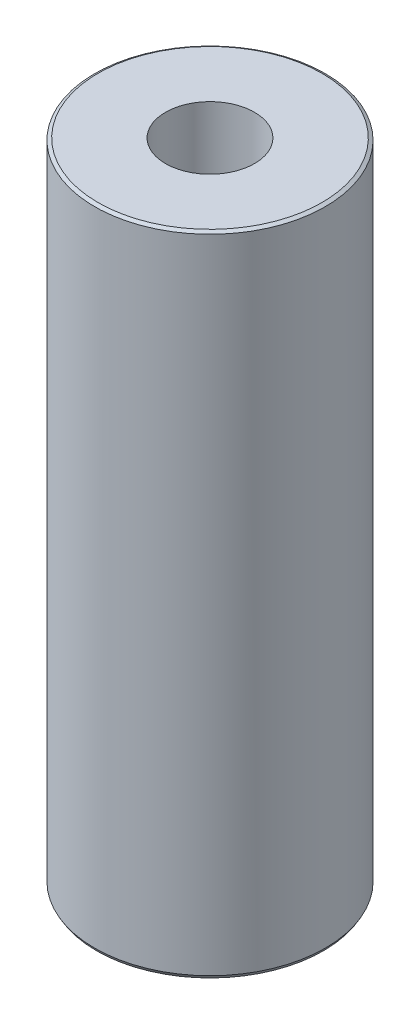
ISO-10303-21;
HEADER;
FILE_DESCRIPTION(('STEP AP214'),'2;1');
FILE_NAME('part.step','',(''),(''),'','','');
FILE_SCHEMA(('AUTOMOTIVE_DESIGN { 1 0 10303 214 1 1 1 1 }'));
ENDSEC;
DATA;
#1=APPLICATION_CONTEXT('core data for automotive mechanical design processes');
#2=APPLICATION_PROTOCOL_DEFINITION('international standard','automotive_design',2000,#1);
#3=PRODUCT_CONTEXT('',#1,'mechanical');
#4=PRODUCT('Part','Part','',(#3));
#5=PRODUCT_RELATED_PRODUCT_CATEGORY('part','',(#4));
#6=PRODUCT_DEFINITION_FORMATION('','',#4);
#7=PRODUCT_DEFINITION_CONTEXT('part definition',#1,'design');
#8=PRODUCT_DEFINITION('design','',#6,#7);
#9=PRODUCT_DEFINITION_SHAPE('','',#8);
#10=(LENGTH_UNIT() NAMED_UNIT(*) SI_UNIT(.MILLI.,.METRE.));
#11=(NAMED_UNIT(*) PLANE_ANGLE_UNIT() SI_UNIT($,.RADIAN.));
#12=(NAMED_UNIT(*) SI_UNIT($,.STERADIAN.) SOLID_ANGLE_UNIT());
#13=UNCERTAINTY_MEASURE_WITH_UNIT(LENGTH_MEASURE(1.E-05),#10,'distance_accuracy_value','');
#14=(GEOMETRIC_REPRESENTATION_CONTEXT(3) GLOBAL_UNCERTAINTY_ASSIGNED_CONTEXT((#13)) GLOBAL_UNIT_ASSIGNED_CONTEXT((#10,
#11,#12)) REPRESENTATION_CONTEXT('',''));
#15=CARTESIAN_POINT('',(0.,0.,0.));
#16=DIRECTION('',(0.,0.,1.));
#17=DIRECTION('',(1.,0.,0.));
#18=AXIS2_PLACEMENT_3D('',#15,#16,#17);
#19=CARTESIAN_POINT('',(0.,126.322816713303,0.));
#20=DIRECTION('',(0.,-1.,0.));
#21=DIRECTION('',(0.,0.,-1.));
#22=AXIS2_PLACEMENT_3D('',#19,#20,#21);
#23=CYLINDRICAL_SURFACE('',#22,22.5);
#24=CARTESIAN_POINT('',(0.,125.94822007938,0.));
#25=DIRECTION('',(0.,1.,0.));
#26=DIRECTION('',(0.,0.,1.));
#27=AXIS2_PLACEMENT_3D('',#24,#25,#26);
#28=CIRCLE('',#27,22.5);
#29=CARTESIAN_POINT('',(0.,125.94822007938,-22.5));
#30=VERTEX_POINT('',#29);
#31=EDGE_CURVE('E50',#30,#30,#28,.F.);
#32=ORIENTED_EDGE('',*,*,#31,.T.);
#33=EDGE_LOOP('',(#32));
#34=FACE_BOUND('',#33,.T.);
#35=CARTESIAN_POINT('',(0.,0.648820402297662,0.));
#36=DIRECTION('',(0.,1.,0.));
#37=DIRECTION('',(0.,0.,1.));
#38=AXIS2_PLACEMENT_3D('',#35,#36,#37);
#39=CIRCLE('',#38,22.5);
#40=CARTESIAN_POINT('',(0.,0.648820402297662,22.5));
#41=VERTEX_POINT('',#40);
#42=EDGE_CURVE('E51',#41,#41,#39,.T.);
#43=ORIENTED_EDGE('',*,*,#42,.T.);
#44=EDGE_LOOP('',(#43));
#45=FACE_BOUND('',#44,.T.);
#46=ADVANCED_FACE('F39',(#34,#45),#23,.T.);
#47=CARTESIAN_POINT('',(0.,126.322816713303,0.));
#48=DIRECTION('',(0.,1.,0.));
#49=DIRECTION('',(0.,0.,1.));
#50=AXIS2_PLACEMENT_3D('',#47,#48,#49);
#51=PLANE('',#50);
#52=CARTESIAN_POINT('',(0.,126.322816713303,0.));
#53=DIRECTION('',(0.,1.,0.));
#54=DIRECTION('',(0.,0.,1.));
#55=AXIS2_PLACEMENT_3D('',#52,#53,#54);
#56=CIRCLE('',#55,21.8511795977024);
#57=CARTESIAN_POINT('',(0.,126.322816713303,-21.8511795977024));
#58=VERTEX_POINT('',#57);
#59=EDGE_CURVE('E54',#58,#58,#56,.T.);
#60=ORIENTED_EDGE('',*,*,#59,.T.);
#61=EDGE_LOOP('',(#60));
#62=FACE_BOUND('',#61,.T.);
#63=CARTESIAN_POINT('',(0.,126.322816713303,0.));
#64=DIRECTION('',(0.,1.,0.));
#65=DIRECTION('',(0.,0.,1.));
#66=AXIS2_PLACEMENT_3D('',#63,#64,#65);
#67=CIRCLE('',#66,8.68480394875763);
#68=CARTESIAN_POINT('',(0.,126.322816713303,8.68480394875763));
#69=VERTEX_POINT('',#68);
#70=EDGE_CURVE('E58',#69,#69,#67,.T.);
#71=ORIENTED_EDGE('',*,*,#70,.F.);
#72=EDGE_LOOP('',(#71));
#73=FACE_BOUND('',#72,.T.);
#74=ADVANCED_FACE('F69',(#62,#73),#51,.T.);
#75=CARTESIAN_POINT('',(0.,0.,0.));
#76=DIRECTION('',(0.,1.,0.));
#77=DIRECTION('',(0.,0.,1.));
#78=AXIS2_PLACEMENT_3D('',#75,#76,#77);
#79=PLANE('',#78);
#80=CARTESIAN_POINT('',(0.,0.,0.));
#81=DIRECTION('',(0.,1.,0.));
#82=DIRECTION('',(0.,0.,1.));
#83=AXIS2_PLACEMENT_3D('',#80,#81,#82);
#84=CIRCLE('',#83,22.1254033660777);
#85=CARTESIAN_POINT('',(0.,0.,22.1254033660777));
#86=VERTEX_POINT('',#85);
#87=EDGE_CURVE('E10',#86,#86,#84,.F.);
#88=ORIENTED_EDGE('',*,*,#87,.T.);
#89=EDGE_LOOP('',(#88));
#90=FACE_BOUND('',#89,.T.);
#91=CARTESIAN_POINT('',(0.,0.,0.));
#92=DIRECTION('',(0.,1.,0.));
#93=DIRECTION('',(0.,0.,1.));
#94=AXIS2_PLACEMENT_3D('',#91,#92,#93);
#95=CIRCLE('',#94,8.68480394875763);
#96=CARTESIAN_POINT('',(0.,0.,8.68480394875763));
#97=VERTEX_POINT('',#96);
#98=EDGE_CURVE('E63',#97,#97,#95,.T.);
#99=ORIENTED_EDGE('',*,*,#98,.T.);
#100=EDGE_LOOP('',(#99));
#101=FACE_BOUND('',#100,.T.);
#102=ADVANCED_FACE('F75',(#90,#101),#79,.F.);
#103=CARTESIAN_POINT('',(0.,126.322816713303,0.));
#104=DIRECTION('',(0.,-1.,0.));
#105=DIRECTION('',(0.,0.,-1.));
#106=AXIS2_PLACEMENT_3D('',#103,#104,#105);
#107=CYLINDRICAL_SURFACE('',#106,8.68480394875763);
#108=ORIENTED_EDGE('',*,*,#70,.T.);
#109=EDGE_LOOP('',(#108));
#110=FACE_BOUND('',#109,.T.);
#111=ORIENTED_EDGE('',*,*,#98,.F.);
#112=EDGE_LOOP('',(#111));
#113=FACE_BOUND('',#112,.T.);
#114=ADVANCED_FACE('F70',(#110,#113),#107,.F.);
#115=CARTESIAN_POINT('',(0.,126.322816713303,0.));
#116=DIRECTION('',(0.,-1.,0.));
#117=DIRECTION('',(0.,0.,-1.));
#118=AXIS2_PLACEMENT_3D('',#115,#116,#117);
#119=CONICAL_SURFACE('',#118,21.8511795977024,1.04719755119659);
#120=CARTESIAN_POINT('',(0.,125.94822007938,-22.5));
#121=CARTESIAN_POINT('',(0.,125.95212212765,-22.4932414541428));
#122=CARTESIAN_POINT('',(0.,125.95602417592,-22.4864829082855));
#123=CARTESIAN_POINT('',(0.,125.96382827246,-22.472965816571));
#124=CARTESIAN_POINT('',(0.,125.96773032073,-22.4662072707137));
#125=CARTESIAN_POINT('',(0.,125.97553441727,-22.4526901789992));
#126=CARTESIAN_POINT('',(0.,125.97943646554,-22.4459316331419));
#127=CARTESIAN_POINT('',(0.,125.98724056208,-22.4324145414274));
#128=CARTESIAN_POINT('',(0.,125.991142610351,-22.4256559955701));
#129=CARTESIAN_POINT('',(0.,125.998946706891,-22.4121389038556));
#130=CARTESIAN_POINT('',(0.,126.002848755161,-22.4053803579983));
#131=CARTESIAN_POINT('',(0.,126.010652851701,-22.3918632662838));
#132=CARTESIAN_POINT('',(0.,126.014554899971,-22.3851047204265));
#133=CARTESIAN_POINT('',(0.,126.022358996511,-22.371587628712));
#134=CARTESIAN_POINT('',(0.,126.026261044781,-22.3648290828547));
#135=CARTESIAN_POINT('',(0.,126.034065141321,-22.3513119911402));
#136=CARTESIAN_POINT('',(0.,126.037967189591,-22.3445534452829));
#137=CARTESIAN_POINT('',(0.,126.045771286131,-22.3310363535684));
#138=CARTESIAN_POINT('',(0.,126.049673334401,-22.3242778077111));
#139=CARTESIAN_POINT('',(0.,126.057477430941,-22.3107607159966));
#140=CARTESIAN_POINT('',(0.,126.061379479211,-22.3040021701393));
#141=CARTESIAN_POINT('',(0.,126.069183575751,-22.2904850784248));
#142=CARTESIAN_POINT('',(0.,126.073085624021,-22.2837265325675));
#143=CARTESIAN_POINT('',(0.,126.080889720561,-22.270209440853));
#144=CARTESIAN_POINT('',(0.,126.084791768831,-22.2634508949957));
#145=CARTESIAN_POINT('',(0.,126.092595865371,-22.2499338032812));
#146=CARTESIAN_POINT('',(0.,126.096497913641,-22.2431752574239));
#147=CARTESIAN_POINT('',(0.,126.104302010181,-22.2296581657094));
#148=CARTESIAN_POINT('',(0.,126.108204058451,-22.2228996198521));
#149=CARTESIAN_POINT('',(0.,126.116008154991,-22.2093825281375));
#150=CARTESIAN_POINT('',(0.,126.119910203261,-22.2026239822803));
#151=CARTESIAN_POINT('',(0.,126.127714299801,-22.1891068905658));
#152=CARTESIAN_POINT('',(0.,126.131616348071,-22.1823483447085));
#153=CARTESIAN_POINT('',(0.,126.139420444611,-22.168831252994));
#154=CARTESIAN_POINT('',(0.,126.143322492881,-22.1620727071367));
#155=CARTESIAN_POINT('',(0.,126.151126589421,-22.1485556154222));
#156=CARTESIAN_POINT('',(0.,126.155028637692,-22.1417970695649));
#157=CARTESIAN_POINT('',(0.,126.162832734232,-22.1282799778504));
#158=CARTESIAN_POINT('',(0.,126.166734782502,-22.1215214319931));
#159=CARTESIAN_POINT('',(0.,126.174538879042,-22.1080043402785));
#160=CARTESIAN_POINT('',(0.,126.178440927312,-22.1012457944213));
#161=CARTESIAN_POINT('',(0.,126.186245023852,-22.0877287027068));
#162=CARTESIAN_POINT('',(0.,126.190147072122,-22.0809701568495));
#163=CARTESIAN_POINT('',(0.,126.197951168662,-22.0674530651349));
#164=CARTESIAN_POINT('',(0.,126.201853216932,-22.0606945192777));
#165=CARTESIAN_POINT('',(0.,126.209657313472,-22.0471774275631));
#166=CARTESIAN_POINT('',(0.,126.213559361742,-22.0404188817059));
#167=CARTESIAN_POINT('',(0.,126.221363458282,-22.0269017899914));
#168=CARTESIAN_POINT('',(0.,126.225265506552,-22.0201432441341));
#169=CARTESIAN_POINT('',(0.,126.233069603092,-22.0066261524195));
#170=CARTESIAN_POINT('',(0.,126.236971651362,-21.9998676065623));
#171=CARTESIAN_POINT('',(0.,126.244775747902,-21.9863505148477));
#172=CARTESIAN_POINT('',(0.,126.248677796172,-21.9795919689905));
#173=CARTESIAN_POINT('',(0.,126.256481892712,-21.9660748772759));
#174=CARTESIAN_POINT('',(0.,126.260383940982,-21.9593163314187));
#175=CARTESIAN_POINT('',(0.,126.268188037522,-21.9457992397041));
#176=CARTESIAN_POINT('',(0.,126.272090085792,-21.9390406938469));
#177=CARTESIAN_POINT('',(0.,126.279894182332,-21.9255236021323));
#178=CARTESIAN_POINT('',(0.,126.283796230602,-21.9187650562751));
#179=CARTESIAN_POINT('',(0.,126.291600327142,-21.9052479645605));
#180=CARTESIAN_POINT('',(0.,126.295502375412,-21.8984894187033));
#181=CARTESIAN_POINT('',(0.,126.303306471952,-21.8849723269887));
#182=CARTESIAN_POINT('',(0.,126.307208520222,-21.8782137811315));
#183=CARTESIAN_POINT('',(0.,126.315012616762,-21.8646966894169));
#184=CARTESIAN_POINT('',(0.,126.318914665033,-21.8579381435597));
#185=CARTESIAN_POINT('',(0.,126.322816713303,-21.8511795977024));
#186=B_SPLINE_CURVE_WITH_KNOTS('',3,(#120,#121,#122,#123,#124,#125,#126,#127,#128,#129,#130,
#131,#132,#133,#134,#135,#136,#137,#138,#139,#140,#141,#142,#143,#144,#145,#146,#147,#148,#149,
#150,#151,#152,#153,#154,#155,#156,#157,#158,#159,#160,#161,#162,#163,#164,#165,#166,#167,#168,
#169,#170,#171,#172,#173,#174,#175,#176,#177,#178,#179,#180,#181,#182,#183,#184,#185),
.UNSPECIFIED.,.F.,.F.,(4,2,2,2,2,2,2,2,2,2,2,2,2,2,2,2,2,2,2,2,2,2,2,2,2,2,2,2,2,2,2,2,4),(0.,
0.0234122896201464,0.0468245792402927,0.0702368688604252,0.0936491584805685,0.117061448100715,
0.140473737720847,0.163886027340994,0.187298316961126,0.210710606581273,0.234122896201416,
0.257535185821548,0.280947475441695,0.304359765061841,0.327772054681974,0.35118434430212,
0.374596633922252,0.398008923542396,0.421421213162542,0.444833502782674,0.468245792402821,
0.491658082022967,0.5150703716431,0.538482661263243,0.561894950883389,0.585307240503522,
0.608719530123668,0.632131819743801,0.655544109363947,0.678956398984093,0.702368688604223,
0.725780978224369,0.749193267844515),.UNSPECIFIED.);
#187=EDGE_CURVE('BSEAM81',#30,#58,#186,.T.);
#188=ORIENTED_EDGE('',*,*,#31,.F.);
#189=ORIENTED_EDGE('',*,*,#59,.F.);
#190=ORIENTED_EDGE('',*,*,#187,.T.);
#191=ORIENTED_EDGE('',*,*,#187,.F.);
#192=EDGE_LOOP('',(#188,#190,#189,#191));
#193=FACE_BOUND('',#192,.T.);
#194=ADVANCED_FACE('F81',(#193),#119,.T.);
#195=CARTESIAN_POINT('',(0.,0.648820402297662,0.));
#196=DIRECTION('',(0.,1.,0.));
#197=DIRECTION('',(0.,0.,1.));
#198=AXIS2_PLACEMENT_3D('',#195,#196,#197);
#199=CONICAL_SURFACE('',#198,22.5,0.523598775598292);
#200=ORIENTED_EDGE('',*,*,#87,.F.);
#201=EDGE_LOOP('',(#200));
#202=FACE_BOUND('',#201,.T.);
#203=ORIENTED_EDGE('',*,*,#42,.F.);
#204=EDGE_LOOP('',(#203));
#205=FACE_BOUND('',#204,.T.);
#206=ADVANCED_FACE('F45',(#202,#205),#199,.T.);
#207=CLOSED_SHELL('',(#46,#74,#102,#114,#194,#206));
#208=MANIFOLD_SOLID_BREP('B2',#207);
#209=ADVANCED_BREP_SHAPE_REPRESENTATION('',(#18,#208),#14);
#210=SHAPE_DEFINITION_REPRESENTATION(#9,#209);
ENDSEC;
END-ISO-10303-21;
